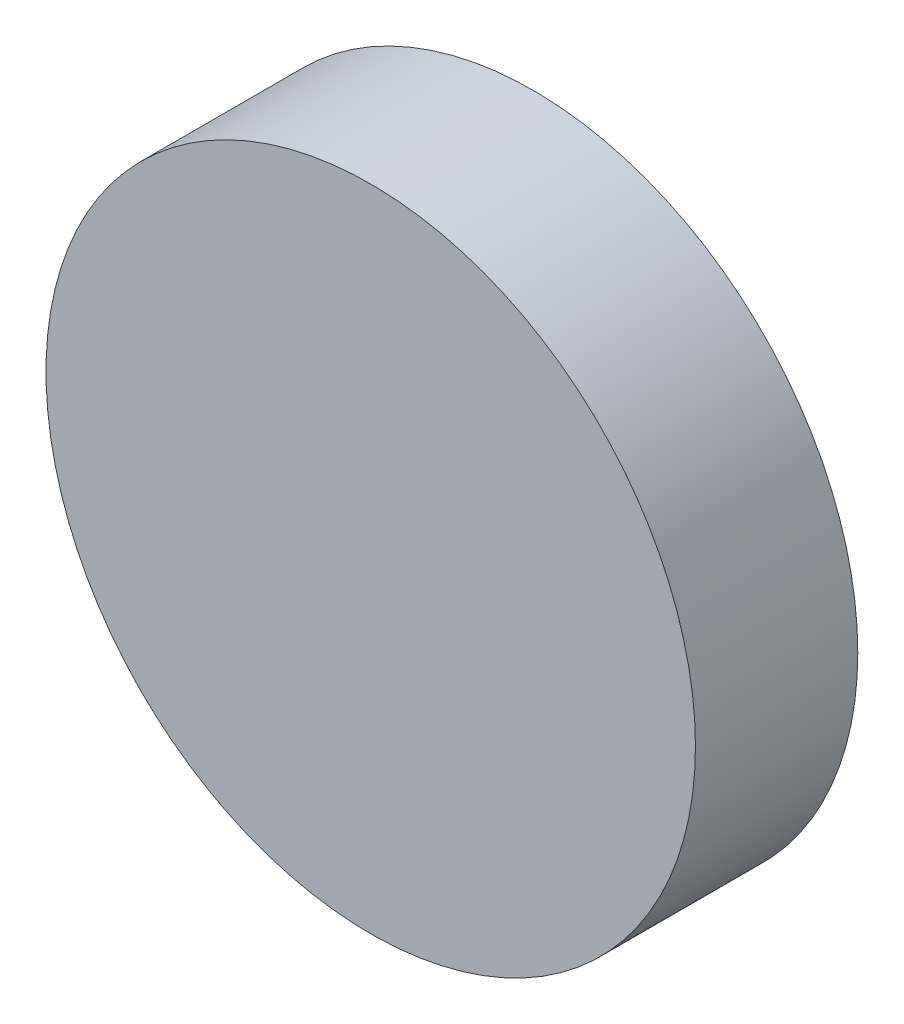
ISO-10303-21;
HEADER;
FILE_DESCRIPTION(('STEP AP214'),'2;1');
FILE_NAME('part.step','',(''),(''),'','','');
FILE_SCHEMA(('AUTOMOTIVE_DESIGN { 1 0 10303 214 1 1 1 1 }'));
ENDSEC;
DATA;
#1=APPLICATION_CONTEXT('core data for automotive mechanical design processes');
#2=APPLICATION_PROTOCOL_DEFINITION('international standard','automotive_design',2000,#1);
#3=PRODUCT_CONTEXT('',#1,'mechanical');
#4=PRODUCT('Part','Part','',(#3));
#5=PRODUCT_RELATED_PRODUCT_CATEGORY('part','',(#4));
#6=PRODUCT_DEFINITION_FORMATION('','',#4);
#7=PRODUCT_DEFINITION_CONTEXT('part definition',#1,'design');
#8=PRODUCT_DEFINITION('design','',#6,#7);
#9=PRODUCT_DEFINITION_SHAPE('','',#8);
#10=(LENGTH_UNIT() NAMED_UNIT(*) SI_UNIT(.MILLI.,.METRE.));
#11=(NAMED_UNIT(*) PLANE_ANGLE_UNIT() SI_UNIT($,.RADIAN.));
#12=(NAMED_UNIT(*) SI_UNIT($,.STERADIAN.) SOLID_ANGLE_UNIT());
#13=UNCERTAINTY_MEASURE_WITH_UNIT(LENGTH_MEASURE(1.E-05),#10,'distance_accuracy_value','');
#14=(GEOMETRIC_REPRESENTATION_CONTEXT(3) GLOBAL_UNCERTAINTY_ASSIGNED_CONTEXT((#13)) GLOBAL_UNIT_ASSIGNED_CONTEXT((#10,
#11,#12)) REPRESENTATION_CONTEXT('',''));
#15=CARTESIAN_POINT('',(0.,0.,0.));
#16=DIRECTION('',(0.,0.,1.));
#17=DIRECTION('',(1.,0.,0.));
#18=AXIS2_PLACEMENT_3D('',#15,#16,#17);
#19=CARTESIAN_POINT('',(0.,0.,25.4));
#20=DIRECTION('',(0.,0.,-1.));
#21=DIRECTION('',(-1.,0.,0.));
#22=AXIS2_PLACEMENT_3D('',#19,#20,#21);
#23=CYLINDRICAL_SURFACE('',#22,50.8);
#24=CARTESIAN_POINT('',(0.,0.,25.4));
#25=DIRECTION('',(0.,0.,1.));
#26=DIRECTION('',(1.,0.,0.));
#27=AXIS2_PLACEMENT_3D('',#24,#25,#26);
#28=CIRCLE('',#27,50.8);
#29=CARTESIAN_POINT('',(50.8,0.,25.4));
#30=VERTEX_POINT('',#29);
#31=EDGE_CURVE('E10',#30,#30,#28,.T.);
#32=ORIENTED_EDGE('',*,*,#31,.F.);
#33=EDGE_LOOP('',(#32));
#34=FACE_BOUND('',#33,.T.);
#35=CARTESIAN_POINT('',(0.,0.,0.));
#36=DIRECTION('',(0.,0.,1.));
#37=DIRECTION('',(1.,0.,0.));
#38=AXIS2_PLACEMENT_3D('',#35,#36,#37);
#39=CIRCLE('',#38,50.8);
#40=CARTESIAN_POINT('',(50.8,0.,0.));
#41=VERTEX_POINT('',#40);
#42=EDGE_CURVE('E46',#41,#41,#39,.T.);
#43=ORIENTED_EDGE('',*,*,#42,.T.);
#44=EDGE_LOOP('',(#43));
#45=FACE_BOUND('',#44,.T.);
#46=ADVANCED_FACE('F43',(#34,#45),#23,.T.);
#47=CARTESIAN_POINT('',(0.,0.,25.4));
#48=DIRECTION('',(0.,0.,1.));
#49=DIRECTION('',(1.,0.,0.));
#50=AXIS2_PLACEMENT_3D('',#47,#48,#49);
#51=PLANE('',#50);
#52=ORIENTED_EDGE('',*,*,#31,.T.);
#53=EDGE_LOOP('',(#52));
#54=FACE_BOUND('',#53,.T.);
#55=ADVANCED_FACE('F60',(#54),#51,.T.);
#56=CARTESIAN_POINT('',(0.,0.,0.));
#57=DIRECTION('',(0.,0.,1.));
#58=DIRECTION('',(1.,0.,0.));
#59=AXIS2_PLACEMENT_3D('',#56,#57,#58);
#60=PLANE('',#59);
#61=ORIENTED_EDGE('',*,*,#42,.F.);
#62=EDGE_LOOP('',(#61));
#63=FACE_BOUND('',#62,.T.);
#64=ADVANCED_FACE('F58',(#63),#60,.F.);
#65=CLOSED_SHELL('',(#46,#55,#64));
#66=MANIFOLD_SOLID_BREP('B2',#65);
#67=ADVANCED_BREP_SHAPE_REPRESENTATION('',(#18,#66),#14);
#68=SHAPE_DEFINITION_REPRESENTATION(#9,#67);
ENDSEC;
END-ISO-10303-21;
